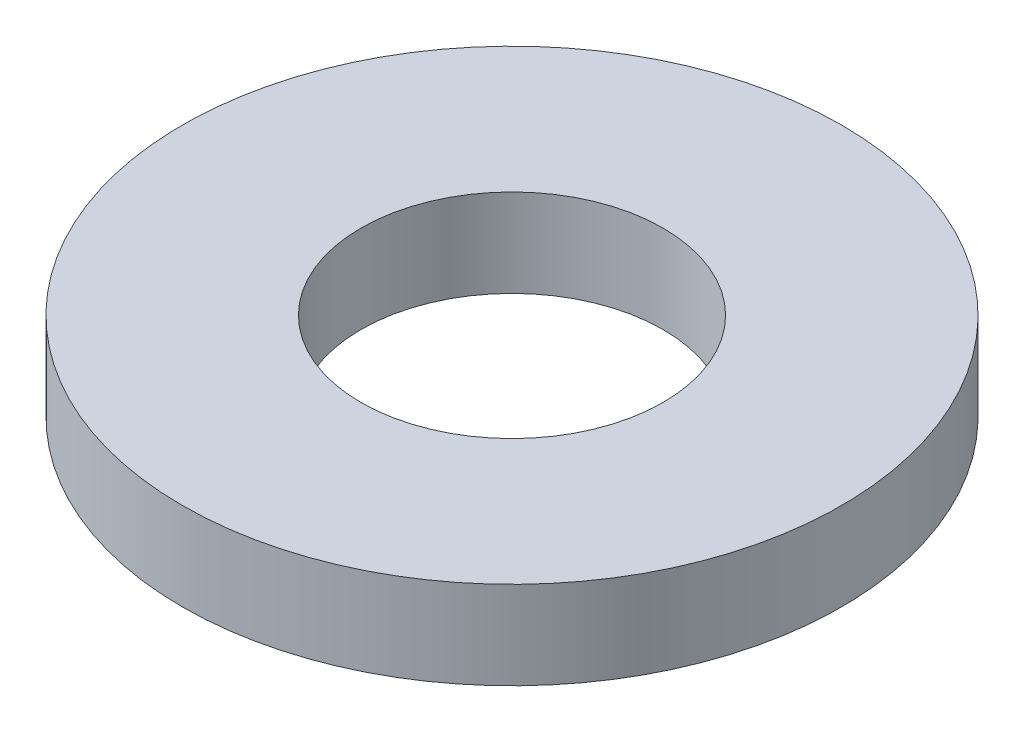
ISO-10303-21;
HEADER;
FILE_DESCRIPTION(('STEP AP214'),'2;1');
FILE_NAME('part.step','',(''),(''),'','','');
FILE_SCHEMA(('AUTOMOTIVE_DESIGN { 1 0 10303 214 1 1 1 1 }'));
ENDSEC;
DATA;
#1=APPLICATION_CONTEXT('core data for automotive mechanical design processes');
#2=APPLICATION_PROTOCOL_DEFINITION('international standard','automotive_design',2000,#1);
#3=PRODUCT_CONTEXT('',#1,'mechanical');
#4=PRODUCT('Part','Part','',(#3));
#5=PRODUCT_RELATED_PRODUCT_CATEGORY('part','',(#4));
#6=PRODUCT_DEFINITION_FORMATION('','',#4);
#7=PRODUCT_DEFINITION_CONTEXT('part definition',#1,'design');
#8=PRODUCT_DEFINITION('design','',#6,#7);
#9=PRODUCT_DEFINITION_SHAPE('','',#8);
#10=(LENGTH_UNIT() NAMED_UNIT(*) SI_UNIT(.MILLI.,.METRE.));
#11=(NAMED_UNIT(*) PLANE_ANGLE_UNIT() SI_UNIT($,.RADIAN.));
#12=(NAMED_UNIT(*) SI_UNIT($,.STERADIAN.) SOLID_ANGLE_UNIT());
#13=UNCERTAINTY_MEASURE_WITH_UNIT(LENGTH_MEASURE(1.E-05),#10,'distance_accuracy_value','');
#14=(GEOMETRIC_REPRESENTATION_CONTEXT(3) GLOBAL_UNCERTAINTY_ASSIGNED_CONTEXT((#13)) GLOBAL_UNIT_ASSIGNED_CONTEXT((#10,
#11,#12)) REPRESENTATION_CONTEXT('',''));
#15=CARTESIAN_POINT('',(0.,0.,0.));
#16=DIRECTION('',(0.,0.,1.));
#17=DIRECTION('',(1.,0.,0.));
#18=AXIS2_PLACEMENT_3D('',#15,#16,#17);
#19=CARTESIAN_POINT('',(0.,16.,0.));
#20=DIRECTION('',(0.,-1.,0.));
#21=DIRECTION('',(0.,0.,-1.));
#22=AXIS2_PLACEMENT_3D('',#19,#20,#21);
#23=CYLINDRICAL_SURFACE('',#22,60.);
#24=CARTESIAN_POINT('',(0.,16.,0.));
#25=DIRECTION('',(0.,1.,0.));
#26=DIRECTION('',(0.,0.,1.));
#27=AXIS2_PLACEMENT_3D('',#24,#25,#26);
#28=CIRCLE('',#27,60.);
#29=CARTESIAN_POINT('',(0.,16.,60.));
#30=VERTEX_POINT('',#29);
#31=EDGE_CURVE('E10',#30,#30,#28,.T.);
#32=ORIENTED_EDGE('',*,*,#31,.F.);
#33=EDGE_LOOP('',(#32));
#34=FACE_BOUND('',#33,.T.);
#35=CARTESIAN_POINT('',(0.,0.,0.));
#36=DIRECTION('',(0.,1.,0.));
#37=DIRECTION('',(0.,0.,1.));
#38=AXIS2_PLACEMENT_3D('',#35,#36,#37);
#39=CIRCLE('',#38,60.);
#40=CARTESIAN_POINT('',(0.,0.,60.));
#41=VERTEX_POINT('',#40);
#42=EDGE_CURVE('E37',#41,#41,#39,.T.);
#43=ORIENTED_EDGE('',*,*,#42,.T.);
#44=EDGE_LOOP('',(#43));
#45=FACE_BOUND('',#44,.T.);
#46=ADVANCED_FACE('F40',(#34,#45),#23,.T.);
#47=CARTESIAN_POINT('',(0.,16.,0.));
#48=DIRECTION('',(0.,1.,0.));
#49=DIRECTION('',(0.,0.,1.));
#50=AXIS2_PLACEMENT_3D('',#47,#48,#49);
#51=PLANE('',#50);
#52=CARTESIAN_POINT('',(0.,16.,0.));
#53=DIRECTION('',(0.,1.,0.));
#54=DIRECTION('',(0.,0.,1.));
#55=AXIS2_PLACEMENT_3D('',#52,#53,#54);
#56=CIRCLE('',#55,27.5);
#57=CARTESIAN_POINT('',(0.,16.,27.5));
#58=VERTEX_POINT('',#57);
#59=EDGE_CURVE('E50',#58,#58,#56,.T.);
#60=ORIENTED_EDGE('',*,*,#59,.F.);
#61=EDGE_LOOP('',(#60));
#62=FACE_BOUND('',#61,.T.);
#63=ORIENTED_EDGE('',*,*,#31,.T.);
#64=EDGE_LOOP('',(#63));
#65=FACE_BOUND('',#64,.T.);
#66=ADVANCED_FACE('F59',(#62,#65),#51,.T.);
#67=CARTESIAN_POINT('',(0.,0.,0.));
#68=DIRECTION('',(0.,1.,0.));
#69=DIRECTION('',(0.,0.,1.));
#70=AXIS2_PLACEMENT_3D('',#67,#68,#69);
#71=PLANE('',#70);
#72=CARTESIAN_POINT('',(0.,0.,0.));
#73=DIRECTION('',(0.,1.,0.));
#74=DIRECTION('',(0.,0.,1.));
#75=AXIS2_PLACEMENT_3D('',#72,#73,#74);
#76=CIRCLE('',#75,27.5);
#77=CARTESIAN_POINT('',(0.,0.,27.5));
#78=VERTEX_POINT('',#77);
#79=EDGE_CURVE('E47',#78,#78,#76,.T.);
#80=ORIENTED_EDGE('',*,*,#79,.T.);
#81=EDGE_LOOP('',(#80));
#82=FACE_BOUND('',#81,.T.);
#83=ORIENTED_EDGE('',*,*,#42,.F.);
#84=EDGE_LOOP('',(#83));
#85=FACE_BOUND('',#84,.T.);
#86=ADVANCED_FACE('F58',(#82,#85),#71,.F.);
#87=CARTESIAN_POINT('',(0.,16.,0.));
#88=DIRECTION('',(0.,-1.,0.));
#89=DIRECTION('',(0.,0.,-1.));
#90=AXIS2_PLACEMENT_3D('',#87,#88,#89);
#91=CYLINDRICAL_SURFACE('',#90,27.5);
#92=ORIENTED_EDGE('',*,*,#59,.T.);
#93=EDGE_LOOP('',(#92));
#94=FACE_BOUND('',#93,.T.);
#95=ORIENTED_EDGE('',*,*,#79,.F.);
#96=EDGE_LOOP('',(#95));
#97=FACE_BOUND('',#96,.T.);
#98=ADVANCED_FACE('F54',(#94,#97),#91,.F.);
#99=CLOSED_SHELL('',(#46,#66,#86,#98));
#100=MANIFOLD_SOLID_BREP('B2',#99);
#101=ADVANCED_BREP_SHAPE_REPRESENTATION('',(#18,#100),#14);
#102=SHAPE_DEFINITION_REPRESENTATION(#9,#101);
ENDSEC;
END-ISO-10303-21;
